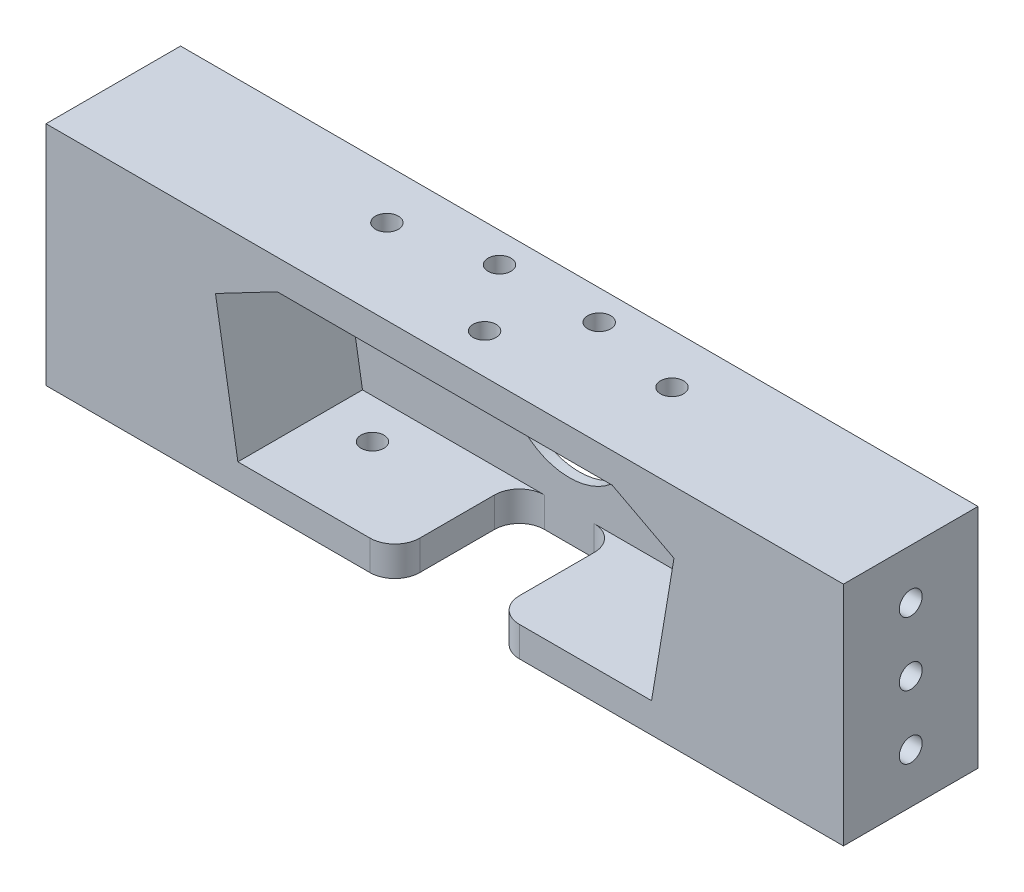
ISO-10303-21;
HEADER;
FILE_DESCRIPTION(('STEP AP214'),'2;1');
FILE_NAME('part.step','',(''),(''),'','','');
FILE_SCHEMA(('AUTOMOTIVE_DESIGN { 1 0 10303 214 1 1 1 1 }'));
ENDSEC;
DATA;
#1=APPLICATION_CONTEXT('core data for automotive mechanical design processes');
#2=APPLICATION_PROTOCOL_DEFINITION('international standard','automotive_design',2000,#1);
#3=PRODUCT_CONTEXT('',#1,'mechanical');
#4=PRODUCT('Part','Part','',(#3));
#5=PRODUCT_RELATED_PRODUCT_CATEGORY('part','',(#4));
#6=PRODUCT_DEFINITION_FORMATION('','',#4);
#7=PRODUCT_DEFINITION_CONTEXT('part definition',#1,'design');
#8=PRODUCT_DEFINITION('design','',#6,#7);
#9=PRODUCT_DEFINITION_SHAPE('','',#8);
#10=(LENGTH_UNIT() NAMED_UNIT(*) SI_UNIT(.MILLI.,.METRE.));
#11=(NAMED_UNIT(*) PLANE_ANGLE_UNIT() SI_UNIT($,.RADIAN.));
#12=(NAMED_UNIT(*) SI_UNIT($,.STERADIAN.) SOLID_ANGLE_UNIT());
#13=UNCERTAINTY_MEASURE_WITH_UNIT(LENGTH_MEASURE(1.E-05),#10,'distance_accuracy_value','');
#14=(GEOMETRIC_REPRESENTATION_CONTEXT(3) GLOBAL_UNCERTAINTY_ASSIGNED_CONTEXT((#13)) GLOBAL_UNIT_ASSIGNED_CONTEXT((#10,
#11,#12)) REPRESENTATION_CONTEXT('',''));
#15=CARTESIAN_POINT('',(0.,0.,0.));
#16=DIRECTION('',(0.,0.,1.));
#17=DIRECTION('',(1.,0.,0.));
#18=AXIS2_PLACEMENT_3D('',#15,#16,#17);
#19=CARTESIAN_POINT('',(41.5,-16.75,25.));
#20=DIRECTION('',(0.,1.,0.));
#21=DIRECTION('',(-1.,0.,0.));
#22=AXIS2_PLACEMENT_3D('',#19,#20,#21);
#23=PLANE('',#22);
#24=CARTESIAN_POINT('',(-31.5,-16.75,8.));
#25=DIRECTION('',(0.,1.,0.));
#26=DIRECTION('',(-1.,0.,0.));
#27=AXIS2_PLACEMENT_3D('',#24,#25,#26);
#28=CIRCLE('',#27,2.3);
#29=CARTESIAN_POINT('',(-33.8,-16.75,8.));
#30=VERTEX_POINT('',#29);
#31=EDGE_CURVE('E392',#30,#30,#28,.T.);
#32=ORIENTED_EDGE('',*,*,#31,.F.);
#33=EDGE_LOOP('',(#32));
#34=FACE_BOUND('',#33,.T.);
#35=DIRECTION('',(1.,0.,0.));
#36=VECTOR('',#35,1.);
#37=CARTESIAN_POINT('',(41.5,-16.75,25.));
#38=LINE('',#37,#36);
#39=CARTESIAN_POINT('',(-41.5,-16.75,25.));
#40=VERTEX_POINT('',#39);
#41=CARTESIAN_POINT('',(-15.,-16.75,25.));
#42=VERTEX_POINT('',#41);
#43=EDGE_CURVE('E205',#40,#42,#38,.T.);
#44=ORIENTED_EDGE('',*,*,#43,.T.);
#45=CARTESIAN_POINT('',(-15.,-16.75,20.));
#46=DIRECTION('',(0.,1.,0.));
#47=DIRECTION('',(-1.,0.,0.));
#48=AXIS2_PLACEMENT_3D('',#45,#46,#47);
#49=CIRCLE('',#48,5.);
#50=CARTESIAN_POINT('',(-9.99999999999999,-16.75,20.));
#51=VERTEX_POINT('',#50);
#52=EDGE_CURVE('E47',#42,#51,#49,.T.);
#53=ORIENTED_EDGE('',*,*,#52,.T.);
#54=DIRECTION('',(0.,0.,1.));
#55=VECTOR('',#54,1.);
#56=CARTESIAN_POINT('',(-10.,-16.75,0.));
#57=LINE('',#56,#55);
#58=CARTESIAN_POINT('',(-10.,-16.75,5.));
#59=VERTEX_POINT('',#58);
#60=EDGE_CURVE('E339',#59,#51,#57,.T.);
#61=ORIENTED_EDGE('',*,*,#60,.F.);
#62=CARTESIAN_POINT('',(-5.,-16.75,5.));
#63=DIRECTION('',(0.,1.,0.));
#64=DIRECTION('',(-1.,0.,0.));
#65=AXIS2_PLACEMENT_3D('',#62,#63,#64);
#66=CIRCLE('',#65,5.);
#67=CARTESIAN_POINT('',(-5.,-16.75,0.));
#68=VERTEX_POINT('',#67);
#69=EDGE_CURVE('E271',#59,#68,#66,.F.);
#70=ORIENTED_EDGE('',*,*,#69,.T.);
#71=DIRECTION('',(1.,0.,0.));
#72=VECTOR('',#71,1.);
#73=CARTESIAN_POINT('',(41.5,-16.75,0.));
#74=LINE('',#73,#72);
#75=CARTESIAN_POINT('',(-41.5,-16.75,0.));
#76=VERTEX_POINT('',#75);
#77=EDGE_CURVE('E221',#76,#68,#74,.T.);
#78=ORIENTED_EDGE('',*,*,#77,.F.);
#79=DIRECTION('',(0.,0.,-1.));
#80=VECTOR('',#79,1.);
#81=CARTESIAN_POINT('',(-41.5,-16.75,25.));
#82=LINE('',#81,#80);
#83=EDGE_CURVE('E239',#40,#76,#82,.T.);
#84=ORIENTED_EDGE('',*,*,#83,.F.);
#85=EDGE_LOOP('',(#44,#53,#61,#70,#78,#84));
#86=FACE_BOUND('',#85,.T.);
#87=ADVANCED_FACE('F39',(#34,#86),#23,.T.);
#88=CARTESIAN_POINT('',(0.,0.,25.));
#89=DIRECTION('',(0.,0.,1.));
#90=DIRECTION('',(1.,0.,0.));
#91=AXIS2_PLACEMENT_3D('',#88,#89,#90);
#92=PLANE('',#91);
#93=CARTESIAN_POINT('',(15.,-16.75,25.));
#94=VERTEX_POINT('',#93);
#95=CARTESIAN_POINT('',(41.5,-16.75,25.));
#96=VERTEX_POINT('',#95);
#97=EDGE_CURVE('E204',#94,#96,#38,.T.);
#98=ORIENTED_EDGE('',*,*,#97,.F.);
#99=DIRECTION('',(0.,1.,0.));
#100=VECTOR('',#99,1.);
#101=CARTESIAN_POINT('',(15.,-22.75,25.));
#102=LINE('',#101,#100);
#103=CARTESIAN_POINT('',(15.,-22.75,25.));
#104=VERTEX_POINT('',#103);
#105=EDGE_CURVE('E285',#94,#104,#102,.F.);
#106=ORIENTED_EDGE('',*,*,#105,.T.);
#107=DIRECTION('',(1.,0.,0.));
#108=VECTOR('',#107,1.);
#109=CARTESIAN_POINT('',(-80.,-22.75,25.));
#110=LINE('',#109,#108);
#111=CARTESIAN_POINT('',(80.,-22.75,25.));
#112=VERTEX_POINT('',#111);
#113=EDGE_CURVE('E249',#104,#112,#110,.T.);
#114=ORIENTED_EDGE('',*,*,#113,.T.);
#115=DIRECTION('',(0.,1.,0.));
#116=VECTOR('',#115,1.);
#117=CARTESIAN_POINT('',(80.,22.75,25.));
#118=LINE('',#117,#116);
#119=CARTESIAN_POINT('',(80.,22.75,25.));
#120=VERTEX_POINT('',#119);
#121=EDGE_CURVE('E244',#112,#120,#118,.T.);
#122=ORIENTED_EDGE('',*,*,#121,.T.);
#123=DIRECTION('',(-1.,0.,0.));
#124=VECTOR('',#123,1.);
#125=CARTESIAN_POINT('',(-80.,22.75,25.));
#126=LINE('',#125,#124);
#127=CARTESIAN_POINT('',(-80.,22.75,25.));
#128=VERTEX_POINT('',#127);
#129=EDGE_CURVE('E168',#120,#128,#126,.T.);
#130=ORIENTED_EDGE('',*,*,#129,.T.);
#131=DIRECTION('',(0.,-1.,0.));
#132=VECTOR('',#131,1.);
#133=CARTESIAN_POINT('',(-80.,22.75,25.));
#134=LINE('',#133,#132);
#135=CARTESIAN_POINT('',(-80.,-22.75,25.));
#136=VERTEX_POINT('',#135);
#137=EDGE_CURVE('E247',#128,#136,#134,.T.);
#138=ORIENTED_EDGE('',*,*,#137,.T.);
#139=CARTESIAN_POINT('',(-15.,-22.75,25.));
#140=VERTEX_POINT('',#139);
#141=EDGE_CURVE('E250',#136,#140,#110,.T.);
#142=ORIENTED_EDGE('',*,*,#141,.T.);
#143=DIRECTION('',(0.,1.,0.));
#144=VECTOR('',#143,1.);
#145=CARTESIAN_POINT('',(-15.,-16.75,25.));
#146=LINE('',#145,#144);
#147=EDGE_CURVE('E282',#140,#42,#146,.T.);
#148=ORIENTED_EDGE('',*,*,#147,.T.);
#149=ORIENTED_EDGE('',*,*,#43,.F.);
#150=DIRECTION('',(0.164398987305357,-0.986393923832144,0.));
#151=VECTOR('',#150,1.);
#152=CARTESIAN_POINT('',(-41.5,-16.75,25.));
#153=LINE('',#152,#151);
#154=CARTESIAN_POINT('',(-46.,10.25,25.));
#155=VERTEX_POINT('',#154);
#156=EDGE_CURVE('E201',#155,#40,#153,.T.);
#157=ORIENTED_EDGE('',*,*,#156,.F.);
#158=DIRECTION('',(-0.88568548340266,-0.464285714285714,0.));
#159=VECTOR('',#158,1.);
#160=CARTESIAN_POINT('',(-46.,10.25,25.));
#161=LINE('',#160,#159);
#162=CARTESIAN_POINT('',(-33.6004032323628,16.75,25.));
#163=VERTEX_POINT('',#162);
#164=EDGE_CURVE('E199',#163,#155,#161,.T.);
#165=ORIENTED_EDGE('',*,*,#164,.F.);
#166=DIRECTION('',(-1.,0.,0.));
#167=VECTOR('',#166,1.);
#168=CARTESIAN_POINT('',(-33.6004032323628,16.75,25.));
#169=LINE('',#168,#167);
#170=CARTESIAN_POINT('',(33.6004032323628,16.75,25.));
#171=VERTEX_POINT('',#170);
#172=EDGE_CURVE('E212',#171,#163,#169,.T.);
#173=ORIENTED_EDGE('',*,*,#172,.F.);
#174=DIRECTION('',(-0.88568548340266,0.464285714285714,0.));
#175=VECTOR('',#174,1.);
#176=CARTESIAN_POINT('',(33.6004032323628,16.75,25.));
#177=LINE('',#176,#175);
#178=CARTESIAN_POINT('',(46.,10.25,25.));
#179=VERTEX_POINT('',#178);
#180=EDGE_CURVE('E209',#179,#171,#177,.T.);
#181=ORIENTED_EDGE('',*,*,#180,.F.);
#182=DIRECTION('',(0.164398987305357,0.986393923832144,0.));
#183=VECTOR('',#182,1.);
#184=CARTESIAN_POINT('',(46.,10.25,25.));
#185=LINE('',#184,#183);
#186=EDGE_CURVE('E207',#96,#179,#185,.T.);
#187=ORIENTED_EDGE('',*,*,#186,.F.);
#188=EDGE_LOOP('',(#98,#106,#114,#122,#130,#138,#142,#148,#149,#157,#165,#173,#181,#187));
#189=FACE_BOUND('',#188,.T.);
#190=ADVANCED_FACE('F316',(#189),#92,.T.);
#191=CARTESIAN_POINT('',(80.,22.75,25.));
#192=DIRECTION('',(-1.,0.,0.));
#193=DIRECTION('',(0.,-1.,0.));
#194=AXIS2_PLACEMENT_3D('',#191,#192,#193);
#195=PLANE('',#194);
#196=CARTESIAN_POINT('',(80.,12.75,11.5));
#197=DIRECTION('',(1.,0.,0.));
#198=DIRECTION('',(0.,1.,0.));
#199=AXIS2_PLACEMENT_3D('',#196,#197,#198);
#200=CIRCLE('',#199,2.3);
#201=CARTESIAN_POINT('',(80.,15.05,11.5));
#202=VERTEX_POINT('',#201);
#203=EDGE_CURVE('E458',#202,#202,#200,.T.);
#204=ORIENTED_EDGE('',*,*,#203,.F.);
#205=EDGE_LOOP('',(#204));
#206=FACE_BOUND('',#205,.T.);
#207=CARTESIAN_POINT('',(80.,0.,11.5));
#208=DIRECTION('',(1.,0.,0.));
#209=DIRECTION('',(0.,1.,0.));
#210=AXIS2_PLACEMENT_3D('',#207,#208,#209);
#211=CIRCLE('',#210,2.3);
#212=CARTESIAN_POINT('',(80.,2.3,11.5));
#213=VERTEX_POINT('',#212);
#214=EDGE_CURVE('E452',#213,#213,#211,.T.);
#215=ORIENTED_EDGE('',*,*,#214,.F.);
#216=EDGE_LOOP('',(#215));
#217=FACE_BOUND('',#216,.T.);
#218=CARTESIAN_POINT('',(80.,-12.75,11.5));
#219=DIRECTION('',(1.,0.,0.));
#220=DIRECTION('',(0.,1.,0.));
#221=AXIS2_PLACEMENT_3D('',#218,#219,#220);
#222=CIRCLE('',#221,2.3);
#223=CARTESIAN_POINT('',(80.,-10.45,11.5));
#224=VERTEX_POINT('',#223);
#225=EDGE_CURVE('E446',#224,#224,#222,.T.);
#226=ORIENTED_EDGE('',*,*,#225,.F.);
#227=EDGE_LOOP('',(#226));
#228=FACE_BOUND('',#227,.T.);
#229=DIRECTION('',(0.,0.,-1.));
#230=VECTOR('',#229,1.);
#231=CARTESIAN_POINT('',(80.,-22.75,25.));
#232=LINE('',#231,#230);
#233=CARTESIAN_POINT('',(80.,-22.75,-2.));
#234=VERTEX_POINT('',#233);
#235=EDGE_CURVE('E179',#112,#234,#232,.T.);
#236=ORIENTED_EDGE('',*,*,#235,.T.);
#237=DIRECTION('',(0.,-1.,0.));
#238=VECTOR('',#237,1.);
#239=CARTESIAN_POINT('',(80.,22.75,-2.));
#240=LINE('',#239,#238);
#241=CARTESIAN_POINT('',(80.,22.75,-2.));
#242=VERTEX_POINT('',#241);
#243=EDGE_CURVE('E176',#242,#234,#240,.T.);
#244=ORIENTED_EDGE('',*,*,#243,.F.);
#245=DIRECTION('',(0.,0.,-1.));
#246=VECTOR('',#245,1.);
#247=CARTESIAN_POINT('',(80.,22.75,25.));
#248=LINE('',#247,#246);
#249=EDGE_CURVE('E162',#120,#242,#248,.T.);
#250=ORIENTED_EDGE('',*,*,#249,.F.);
#251=ORIENTED_EDGE('',*,*,#121,.F.);
#252=EDGE_LOOP('',(#236,#244,#250,#251));
#253=FACE_BOUND('',#252,.T.);
#254=ADVANCED_FACE('F177',(#206,#217,#228,#253),#195,.F.);
#255=CARTESIAN_POINT('',(-80.,22.75,25.));
#256=DIRECTION('',(0.,-1.,0.));
#257=DIRECTION('',(0.,0.,-1.));
#258=AXIS2_PLACEMENT_3D('',#255,#256,#257);
#259=PLANE('',#258);
#260=CARTESIAN_POINT('',(-9.99999999999998,22.75,3.99999999999999));
#261=DIRECTION('',(0.,1.,0.));
#262=DIRECTION('',(0.,0.,1.));
#263=AXIS2_PLACEMENT_3D('',#260,#261,#262);
#264=CIRCLE('',#263,2.3);
#265=CARTESIAN_POINT('',(-9.99999999999998,22.75,6.29999999999999));
#266=VERTEX_POINT('',#265);
#267=EDGE_CURVE('E406',#266,#266,#264,.T.);
#268=ORIENTED_EDGE('',*,*,#267,.F.);
#269=EDGE_LOOP('',(#268));
#270=FACE_BOUND('',#269,.T.);
#271=CARTESIAN_POINT('',(10.,22.75,3.99999999999999));
#272=DIRECTION('',(0.,1.,0.));
#273=DIRECTION('',(0.,0.,1.));
#274=AXIS2_PLACEMENT_3D('',#271,#272,#273);
#275=CIRCLE('',#274,2.3);
#276=CARTESIAN_POINT('',(10.,22.75,6.29999999999999));
#277=VERTEX_POINT('',#276);
#278=EDGE_CURVE('E418',#277,#277,#275,.T.);
#279=ORIENTED_EDGE('',*,*,#278,.F.);
#280=EDGE_LOOP('',(#279));
#281=FACE_BOUND('',#280,.T.);
#282=CARTESIAN_POINT('',(0.,22.75,17.));
#283=DIRECTION('',(0.,1.,0.));
#284=DIRECTION('',(0.,0.,1.));
#285=AXIS2_PLACEMENT_3D('',#282,#283,#284);
#286=CIRCLE('',#285,2.3);
#287=CARTESIAN_POINT('',(0.,22.75,19.3));
#288=VERTEX_POINT('',#287);
#289=EDGE_CURVE('E413',#288,#288,#286,.T.);
#290=ORIENTED_EDGE('',*,*,#289,.F.);
#291=EDGE_LOOP('',(#290));
#292=FACE_BOUND('',#291,.T.);
#293=CARTESIAN_POINT('',(-28.6004032323627,22.75,8.));
#294=DIRECTION('',(0.,-1.,0.));
#295=DIRECTION('',(0.,0.,-1.));
#296=AXIS2_PLACEMENT_3D('',#293,#294,#295);
#297=CIRCLE('',#296,2.3);
#298=CARTESIAN_POINT('',(-28.6004032323627,22.75,5.7));
#299=VERTEX_POINT('',#298);
#300=EDGE_CURVE('E389',#299,#299,#297,.F.);
#301=ORIENTED_EDGE('',*,*,#300,.F.);
#302=EDGE_LOOP('',(#301));
#303=FACE_BOUND('',#302,.T.);
#304=CARTESIAN_POINT('',(28.6004032323628,22.75,8.));
#305=DIRECTION('',(0.,-1.,0.));
#306=DIRECTION('',(0.,0.,-1.));
#307=AXIS2_PLACEMENT_3D('',#304,#305,#306);
#308=CIRCLE('',#307,2.3);
#309=CARTESIAN_POINT('',(28.6004032323628,22.75,5.7));
#310=VERTEX_POINT('',#309);
#311=EDGE_CURVE('E401',#310,#310,#308,.F.);
#312=ORIENTED_EDGE('',*,*,#311,.F.);
#313=EDGE_LOOP('',(#312));
#314=FACE_BOUND('',#313,.T.);
#315=ORIENTED_EDGE('',*,*,#249,.T.);
#316=DIRECTION('',(1.,0.,0.));
#317=VECTOR('',#316,1.);
#318=CARTESIAN_POINT('',(-80.,22.75,-2.));
#319=LINE('',#318,#317);
#320=CARTESIAN_POINT('',(-80.,22.75,-2.));
#321=VERTEX_POINT('',#320);
#322=EDGE_CURVE('E167',#321,#242,#319,.T.);
#323=ORIENTED_EDGE('',*,*,#322,.F.);
#324=DIRECTION('',(0.,0.,-1.));
#325=VECTOR('',#324,1.);
#326=CARTESIAN_POINT('',(-80.,22.75,25.));
#327=LINE('',#326,#325);
#328=EDGE_CURVE('E173',#128,#321,#327,.T.);
#329=ORIENTED_EDGE('',*,*,#328,.F.);
#330=ORIENTED_EDGE('',*,*,#129,.F.);
#331=EDGE_LOOP('',(#315,#323,#329,#330));
#332=FACE_BOUND('',#331,.T.);
#333=ADVANCED_FACE('F164',(#270,#281,#292,#303,#314,#332),#259,.F.);
#334=CARTESIAN_POINT('',(-80.,22.75,25.));
#335=DIRECTION('',(1.,0.,0.));
#336=DIRECTION('',(0.,0.,-1.));
#337=AXIS2_PLACEMENT_3D('',#334,#335,#336);
#338=PLANE('',#337);
#339=CARTESIAN_POINT('',(-80.,12.75,11.5));
#340=DIRECTION('',(-1.,0.,0.));
#341=DIRECTION('',(0.,0.,1.));
#342=AXIS2_PLACEMENT_3D('',#339,#340,#341);
#343=CIRCLE('',#342,2.3);
#344=CARTESIAN_POINT('',(-80.,12.75,13.8));
#345=VERTEX_POINT('',#344);
#346=EDGE_CURVE('E434',#345,#345,#343,.T.);
#347=ORIENTED_EDGE('',*,*,#346,.F.);
#348=EDGE_LOOP('',(#347));
#349=FACE_BOUND('',#348,.T.);
#350=CARTESIAN_POINT('',(-80.,-12.75,11.5));
#351=DIRECTION('',(-1.,0.,0.));
#352=DIRECTION('',(0.,0.,1.));
#353=AXIS2_PLACEMENT_3D('',#350,#351,#352);
#354=CIRCLE('',#353,2.3);
#355=CARTESIAN_POINT('',(-80.,-12.75,13.8));
#356=VERTEX_POINT('',#355);
#357=EDGE_CURVE('E441',#356,#356,#354,.T.);
#358=ORIENTED_EDGE('',*,*,#357,.F.);
#359=EDGE_LOOP('',(#358));
#360=FACE_BOUND('',#359,.T.);
#361=CARTESIAN_POINT('',(-80.,0.,11.5));
#362=DIRECTION('',(-1.,0.,0.));
#363=DIRECTION('',(0.,0.,1.));
#364=AXIS2_PLACEMENT_3D('',#361,#362,#363);
#365=CIRCLE('',#364,2.3);
#366=CARTESIAN_POINT('',(-80.,0.,13.8));
#367=VERTEX_POINT('',#366);
#368=EDGE_CURVE('E428',#367,#367,#365,.T.);
#369=ORIENTED_EDGE('',*,*,#368,.F.);
#370=EDGE_LOOP('',(#369));
#371=FACE_BOUND('',#370,.T.);
#372=ORIENTED_EDGE('',*,*,#328,.T.);
#373=DIRECTION('',(0.,1.,0.));
#374=VECTOR('',#373,1.);
#375=CARTESIAN_POINT('',(-80.,-22.75,-2.));
#376=LINE('',#375,#374);
#377=CARTESIAN_POINT('',(-80.,-22.75,-2.));
#378=VERTEX_POINT('',#377);
#379=EDGE_CURVE('E188',#378,#321,#376,.T.);
#380=ORIENTED_EDGE('',*,*,#379,.F.);
#381=DIRECTION('',(0.,0.,-1.));
#382=VECTOR('',#381,1.);
#383=CARTESIAN_POINT('',(-80.,-22.75,25.));
#384=LINE('',#383,#382);
#385=EDGE_CURVE('E254',#136,#378,#384,.T.);
#386=ORIENTED_EDGE('',*,*,#385,.F.);
#387=ORIENTED_EDGE('',*,*,#137,.F.);
#388=EDGE_LOOP('',(#372,#380,#386,#387));
#389=FACE_BOUND('',#388,.T.);
#390=ADVANCED_FACE('F587',(#349,#360,#371,#389),#338,.F.);
#391=CARTESIAN_POINT('',(-80.,-22.75,25.));
#392=DIRECTION('',(0.,1.,0.));
#393=DIRECTION('',(0.,0.,1.));
#394=AXIS2_PLACEMENT_3D('',#391,#392,#393);
#395=PLANE('',#394);
#396=CARTESIAN_POINT('',(-31.5,-22.75,8.));
#397=DIRECTION('',(0.,1.,0.));
#398=DIRECTION('',(0.,0.,1.));
#399=AXIS2_PLACEMENT_3D('',#396,#397,#398);
#400=CIRCLE('',#399,2.3);
#401=CARTESIAN_POINT('',(-31.5,-22.75,10.3));
#402=VERTEX_POINT('',#401);
#403=EDGE_CURVE('E306',#402,#402,#400,.F.);
#404=ORIENTED_EDGE('',*,*,#403,.F.);
#405=EDGE_LOOP('',(#404));
#406=FACE_BOUND('',#405,.T.);
#407=CARTESIAN_POINT('',(31.5,-22.75,8.));
#408=DIRECTION('',(0.,1.,0.));
#409=DIRECTION('',(0.,0.,1.));
#410=AXIS2_PLACEMENT_3D('',#407,#408,#409);
#411=CIRCLE('',#410,2.3);
#412=CARTESIAN_POINT('',(31.5,-22.75,10.3));
#413=VERTEX_POINT('',#412);
#414=EDGE_CURVE('E388',#413,#413,#411,.F.);
#415=ORIENTED_EDGE('',*,*,#414,.F.);
#416=EDGE_LOOP('',(#415));
#417=FACE_BOUND('',#416,.T.);
#418=ORIENTED_EDGE('',*,*,#113,.F.);
#419=CARTESIAN_POINT('',(15.,-22.75,20.));
#420=DIRECTION('',(0.,1.,0.));
#421=DIRECTION('',(0.,0.,1.));
#422=AXIS2_PLACEMENT_3D('',#419,#420,#421);
#423=CIRCLE('',#422,5.);
#424=CARTESIAN_POINT('',(10.,-22.75,20.));
#425=VERTEX_POINT('',#424);
#426=EDGE_CURVE('E289',#104,#425,#423,.F.);
#427=ORIENTED_EDGE('',*,*,#426,.T.);
#428=DIRECTION('',(0.,0.,1.));
#429=VECTOR('',#428,1.);
#430=CARTESIAN_POINT('',(10.,-22.75,0.));
#431=LINE('',#430,#429);
#432=CARTESIAN_POINT('',(10.,-22.75,5.));
#433=VERTEX_POINT('',#432);
#434=EDGE_CURVE('E296',#433,#425,#431,.T.);
#435=ORIENTED_EDGE('',*,*,#434,.F.);
#436=CARTESIAN_POINT('',(5.,-22.75,5.));
#437=DIRECTION('',(0.,1.,0.));
#438=DIRECTION('',(0.,0.,1.));
#439=AXIS2_PLACEMENT_3D('',#436,#437,#438);
#440=CIRCLE('',#439,5.);
#441=CARTESIAN_POINT('',(5.,-22.75,0.));
#442=VERTEX_POINT('',#441);
#443=EDGE_CURVE('E269',#433,#442,#440,.T.);
#444=ORIENTED_EDGE('',*,*,#443,.T.);
#445=DIRECTION('',(1.,0.,0.));
#446=VECTOR('',#445,1.);
#447=CARTESIAN_POINT('',(-10.,-22.75,0.));
#448=LINE('',#447,#446);
#449=CARTESIAN_POINT('',(-5.,-22.75,0.));
#450=VERTEX_POINT('',#449);
#451=EDGE_CURVE('E305',#450,#442,#448,.T.);
#452=ORIENTED_EDGE('',*,*,#451,.F.);
#453=CARTESIAN_POINT('',(-5.,-22.75,5.));
#454=DIRECTION('',(0.,1.,0.));
#455=DIRECTION('',(0.,0.,1.));
#456=AXIS2_PLACEMENT_3D('',#453,#454,#455);
#457=CIRCLE('',#456,5.);
#458=CARTESIAN_POINT('',(-10.,-22.75,5.));
#459=VERTEX_POINT('',#458);
#460=EDGE_CURVE('E274',#450,#459,#457,.T.);
#461=ORIENTED_EDGE('',*,*,#460,.T.);
#462=DIRECTION('',(0.,0.,-1.));
#463=VECTOR('',#462,1.);
#464=CARTESIAN_POINT('',(-10.,-22.75,0.));
#465=LINE('',#464,#463);
#466=CARTESIAN_POINT('',(-9.99999999999999,-22.75,20.));
#467=VERTEX_POINT('',#466);
#468=EDGE_CURVE('E337',#467,#459,#465,.T.);
#469=ORIENTED_EDGE('',*,*,#468,.F.);
#470=CARTESIAN_POINT('',(-15.,-22.75,20.));
#471=DIRECTION('',(0.,1.,0.));
#472=DIRECTION('',(0.,0.,1.));
#473=AXIS2_PLACEMENT_3D('',#470,#471,#472);
#474=CIRCLE('',#473,5.);
#475=EDGE_CURVE('E287',#467,#140,#474,.F.);
#476=ORIENTED_EDGE('',*,*,#475,.T.);
#477=ORIENTED_EDGE('',*,*,#141,.F.);
#478=ORIENTED_EDGE('',*,*,#385,.T.);
#479=DIRECTION('',(-1.,0.,0.));
#480=VECTOR('',#479,1.);
#481=CARTESIAN_POINT('',(80.,-22.75,-2.));
#482=LINE('',#481,#480);
#483=EDGE_CURVE('E183',#234,#378,#482,.T.);
#484=ORIENTED_EDGE('',*,*,#483,.F.);
#485=ORIENTED_EDGE('',*,*,#235,.F.);
#486=EDGE_LOOP('',(#418,#427,#435,#444,#452,#461,#469,#476,#477,#478,#484,#485));
#487=FACE_BOUND('',#486,.T.);
#488=ADVANCED_FACE('F295',(#406,#417,#487),#395,.F.);
#489=CARTESIAN_POINT('',(-46.,10.25,25.));
#490=DIRECTION('',(0.464285714285714,-0.88568548340266,0.));
#491=DIRECTION('',(0.88568548340266,0.464285714285714,0.));
#492=AXIS2_PLACEMENT_3D('',#489,#490,#491);
#493=PLANE('',#492);
#494=DIRECTION('',(-0.88568548340266,-0.464285714285714,0.));
#495=VECTOR('',#494,1.);
#496=CARTESIAN_POINT('',(-46.,10.25,0.));
#497=LINE('',#496,#495);
#498=CARTESIAN_POINT('',(-33.6004032323628,16.75,0.));
#499=VERTEX_POINT('',#498);
#500=CARTESIAN_POINT('',(-46.,10.25,0.));
#501=VERTEX_POINT('',#500);
#502=EDGE_CURVE('E198',#499,#501,#497,.T.);
#503=ORIENTED_EDGE('',*,*,#502,.F.);
#504=DIRECTION('',(0.,0.,-1.));
#505=VECTOR('',#504,1.);
#506=CARTESIAN_POINT('',(-33.6004032323628,16.75,25.));
#507=LINE('',#506,#505);
#508=EDGE_CURVE('E214',#163,#499,#507,.T.);
#509=ORIENTED_EDGE('',*,*,#508,.F.);
#510=ORIENTED_EDGE('',*,*,#164,.T.);
#511=DIRECTION('',(0.,0.,-1.));
#512=VECTOR('',#511,1.);
#513=CARTESIAN_POINT('',(-46.,10.25,25.));
#514=LINE('',#513,#512);
#515=EDGE_CURVE('E241',#155,#501,#514,.T.);
#516=ORIENTED_EDGE('',*,*,#515,.T.);
#517=EDGE_LOOP('',(#503,#509,#510,#516));
#518=FACE_BOUND('',#517,.T.);
#519=ADVANCED_FACE('F382',(#518),#493,.T.);
#520=CARTESIAN_POINT('',(-41.5,-16.75,25.));
#521=DIRECTION('',(0.986393923832144,0.164398987305357,0.));
#522=DIRECTION('',(-0.164398987305357,0.986393923832144,0.));
#523=AXIS2_PLACEMENT_3D('',#520,#521,#522);
#524=PLANE('',#523);
#525=DIRECTION('',(0.164398987305357,-0.986393923832144,0.));
#526=VECTOR('',#525,1.);
#527=CARTESIAN_POINT('',(-41.5,-16.75,0.));
#528=LINE('',#527,#526);
#529=EDGE_CURVE('E217',#501,#76,#528,.T.);
#530=ORIENTED_EDGE('',*,*,#529,.F.);
#531=ORIENTED_EDGE('',*,*,#515,.F.);
#532=ORIENTED_EDGE('',*,*,#156,.T.);
#533=ORIENTED_EDGE('',*,*,#83,.T.);
#534=EDGE_LOOP('',(#530,#531,#532,#533));
#535=FACE_BOUND('',#534,.T.);
#536=ADVANCED_FACE('F375',(#535),#524,.T.);
#537=CARTESIAN_POINT('',(31.5,-16.75,8.));
#538=DIRECTION('',(0.,1.,0.));
#539=DIRECTION('',(-1.,0.,0.));
#540=AXIS2_PLACEMENT_3D('',#537,#538,#539);
#541=CIRCLE('',#540,2.3);
#542=CARTESIAN_POINT('',(29.2,-16.75,8.));
#543=VERTEX_POINT('',#542);
#544=EDGE_CURVE('E386',#543,#543,#541,.T.);
#545=ORIENTED_EDGE('',*,*,#544,.F.);
#546=EDGE_LOOP('',(#545));
#547=FACE_BOUND('',#546,.T.);
#548=DIRECTION('',(0.,0.,-1.));
#549=VECTOR('',#548,1.);
#550=CARTESIAN_POINT('',(10.,-16.75,0.));
#551=LINE('',#550,#549);
#552=CARTESIAN_POINT('',(10.,-16.75,20.));
#553=VERTEX_POINT('',#552);
#554=CARTESIAN_POINT('',(10.,-16.75,5.));
#555=VERTEX_POINT('',#554);
#556=EDGE_CURVE('E313',#553,#555,#551,.T.);
#557=ORIENTED_EDGE('',*,*,#556,.F.);
#558=CARTESIAN_POINT('',(15.,-16.75,20.));
#559=DIRECTION('',(0.,1.,0.));
#560=DIRECTION('',(-1.,0.,0.));
#561=AXIS2_PLACEMENT_3D('',#558,#559,#560);
#562=CIRCLE('',#561,5.);
#563=EDGE_CURVE('E280',#553,#94,#562,.T.);
#564=ORIENTED_EDGE('',*,*,#563,.T.);
#565=ORIENTED_EDGE('',*,*,#97,.T.);
#566=DIRECTION('',(0.,0.,-1.));
#567=VECTOR('',#566,1.);
#568=CARTESIAN_POINT('',(41.5,-16.75,25.));
#569=LINE('',#568,#567);
#570=CARTESIAN_POINT('',(41.5,-16.75,0.));
#571=VERTEX_POINT('',#570);
#572=EDGE_CURVE('E236',#96,#571,#569,.T.);
#573=ORIENTED_EDGE('',*,*,#572,.T.);
#574=CARTESIAN_POINT('',(5.,-16.75,0.));
#575=VERTEX_POINT('',#574);
#576=EDGE_CURVE('E220',#575,#571,#74,.T.);
#577=ORIENTED_EDGE('',*,*,#576,.F.);
#578=CARTESIAN_POINT('',(5.,-16.75,5.));
#579=DIRECTION('',(0.,1.,0.));
#580=DIRECTION('',(-1.,0.,0.));
#581=AXIS2_PLACEMENT_3D('',#578,#579,#580);
#582=CIRCLE('',#581,5.);
#583=EDGE_CURVE('E266',#575,#555,#582,.F.);
#584=ORIENTED_EDGE('',*,*,#583,.T.);
#585=EDGE_LOOP('',(#557,#564,#565,#573,#577,#584));
#586=FACE_BOUND('',#585,.T.);
#587=ADVANCED_FACE('F311',(#547,#586),#23,.T.);
#588=CARTESIAN_POINT('',(46.,10.25,25.));
#589=DIRECTION('',(-0.986393923832144,0.164398987305357,0.));
#590=DIRECTION('',(-0.164398987305357,-0.986393923832144,0.));
#591=AXIS2_PLACEMENT_3D('',#588,#589,#590);
#592=PLANE('',#591);
#593=DIRECTION('',(0.164398987305357,0.986393923832144,0.));
#594=VECTOR('',#593,1.);
#595=CARTESIAN_POINT('',(46.,10.25,0.));
#596=LINE('',#595,#594);
#597=CARTESIAN_POINT('',(46.,10.25,0.));
#598=VERTEX_POINT('',#597);
#599=EDGE_CURVE('E223',#571,#598,#596,.T.);
#600=ORIENTED_EDGE('',*,*,#599,.F.);
#601=ORIENTED_EDGE('',*,*,#572,.F.);
#602=ORIENTED_EDGE('',*,*,#186,.T.);
#603=DIRECTION('',(0.,0.,-1.));
#604=VECTOR('',#603,1.);
#605=CARTESIAN_POINT('',(46.,10.25,25.));
#606=LINE('',#605,#604);
#607=EDGE_CURVE('E234',#179,#598,#606,.T.);
#608=ORIENTED_EDGE('',*,*,#607,.T.);
#609=EDGE_LOOP('',(#600,#601,#602,#608));
#610=FACE_BOUND('',#609,.T.);
#611=ADVANCED_FACE('F322',(#610),#592,.T.);
#612=CARTESIAN_POINT('',(33.6004032323628,16.75,25.));
#613=DIRECTION('',(-0.464285714285715,-0.88568548340266,0.));
#614=DIRECTION('',(0.88568548340266,-0.464285714285714,0.));
#615=AXIS2_PLACEMENT_3D('',#612,#613,#614);
#616=PLANE('',#615);
#617=DIRECTION('',(-0.88568548340266,0.464285714285714,0.));
#618=VECTOR('',#617,1.);
#619=CARTESIAN_POINT('',(33.6004032323628,16.75,0.));
#620=LINE('',#619,#618);
#621=CARTESIAN_POINT('',(33.6004032323628,16.75,0.));
#622=VERTEX_POINT('',#621);
#623=EDGE_CURVE('E226',#598,#622,#620,.T.);
#624=ORIENTED_EDGE('',*,*,#623,.F.);
#625=ORIENTED_EDGE('',*,*,#607,.F.);
#626=ORIENTED_EDGE('',*,*,#180,.T.);
#627=DIRECTION('',(0.,0.,-1.));
#628=VECTOR('',#627,1.);
#629=CARTESIAN_POINT('',(33.6004032323628,16.75,25.));
#630=LINE('',#629,#628);
#631=EDGE_CURVE('E232',#171,#622,#630,.T.);
#632=ORIENTED_EDGE('',*,*,#631,.T.);
#633=EDGE_LOOP('',(#624,#625,#626,#632));
#634=FACE_BOUND('',#633,.T.);
#635=ADVANCED_FACE('F325',(#634),#616,.T.);
#636=CARTESIAN_POINT('',(-33.6004032323628,16.75,25.));
#637=DIRECTION('',(0.,-1.,0.));
#638=DIRECTION('',(1.,0.,0.));
#639=AXIS2_PLACEMENT_3D('',#636,#637,#638);
#640=PLANE('',#639);
#641=CARTESIAN_POINT('',(-9.99999999999998,16.75,3.99999999999999));
#642=DIRECTION('',(0.,-1.,0.));
#643=DIRECTION('',(1.,0.,0.));
#644=AXIS2_PLACEMENT_3D('',#641,#642,#643);
#645=CIRCLE('',#644,2.3);
#646=CARTESIAN_POINT('',(-7.69999999999998,16.75,3.99999999999999));
#647=VERTEX_POINT('',#646);
#648=EDGE_CURVE('E421',#647,#647,#645,.F.);
#649=ORIENTED_EDGE('',*,*,#648,.T.);
#650=EDGE_LOOP('',(#649));
#651=FACE_BOUND('',#650,.T.);
#652=CARTESIAN_POINT('',(10.,16.75,3.99999999999999));
#653=DIRECTION('',(0.,-1.,0.));
#654=DIRECTION('',(1.,0.,0.));
#655=AXIS2_PLACEMENT_3D('',#652,#653,#654);
#656=CIRCLE('',#655,2.3);
#657=CARTESIAN_POINT('',(12.3,16.75,3.99999999999999));
#658=VERTEX_POINT('',#657);
#659=EDGE_CURVE('E417',#658,#658,#656,.F.);
#660=ORIENTED_EDGE('',*,*,#659,.T.);
#661=EDGE_LOOP('',(#660));
#662=FACE_BOUND('',#661,.T.);
#663=CARTESIAN_POINT('',(0.,16.75,17.));
#664=DIRECTION('',(0.,-1.,0.));
#665=DIRECTION('',(1.,0.,0.));
#666=AXIS2_PLACEMENT_3D('',#663,#664,#665);
#667=CIRCLE('',#666,2.3);
#668=CARTESIAN_POINT('',(2.3,16.75,17.));
#669=VERTEX_POINT('',#668);
#670=EDGE_CURVE('E410',#669,#669,#667,.F.);
#671=ORIENTED_EDGE('',*,*,#670,.T.);
#672=EDGE_LOOP('',(#671));
#673=FACE_BOUND('',#672,.T.);
#674=CARTESIAN_POINT('',(-28.6004032323627,16.75,8.));
#675=DIRECTION('',(0.,-1.,0.));
#676=DIRECTION('',(0.,0.,-1.));
#677=AXIS2_PLACEMENT_3D('',#674,#675,#676);
#678=CIRCLE('',#677,2.3);
#679=CARTESIAN_POINT('',(-28.6004032323627,16.75,5.7));
#680=VERTEX_POINT('',#679);
#681=EDGE_CURVE('E394',#680,#680,#678,.T.);
#682=ORIENTED_EDGE('',*,*,#681,.F.);
#683=EDGE_LOOP('',(#682));
#684=FACE_BOUND('',#683,.T.);
#685=CARTESIAN_POINT('',(28.6004032323628,16.75,8.));
#686=DIRECTION('',(0.,-1.,0.));
#687=DIRECTION('',(0.,0.,-1.));
#688=AXIS2_PLACEMENT_3D('',#685,#686,#687);
#689=CIRCLE('',#688,2.3);
#690=CARTESIAN_POINT('',(28.6004032323628,16.75,5.7));
#691=VERTEX_POINT('',#690);
#692=EDGE_CURVE('E404',#691,#691,#689,.T.);
#693=ORIENTED_EDGE('',*,*,#692,.F.);
#694=EDGE_LOOP('',(#693));
#695=FACE_BOUND('',#694,.T.);
#696=DIRECTION('',(-1.,0.,0.));
#697=VECTOR('',#696,1.);
#698=CARTESIAN_POINT('',(-33.6004032323628,16.75,0.));
#699=LINE('',#698,#697);
#700=EDGE_CURVE('E202',#622,#499,#699,.T.);
#701=ORIENTED_EDGE('',*,*,#700,.F.);
#702=ORIENTED_EDGE('',*,*,#631,.F.);
#703=ORIENTED_EDGE('',*,*,#172,.T.);
#704=ORIENTED_EDGE('',*,*,#508,.T.);
#705=EDGE_LOOP('',(#701,#702,#703,#704));
#706=FACE_BOUND('',#705,.T.);
#707=ADVANCED_FACE('F350',(#651,#662,#673,#684,#695,#706),#640,.T.);
#708=CARTESIAN_POINT('',(0.,0.,0.));
#709=DIRECTION('',(0.,0.,-1.));
#710=DIRECTION('',(-1.,0.,0.));
#711=AXIS2_PLACEMENT_3D('',#708,#709,#710);
#712=PLANE('',#711);
#713=CARTESIAN_POINT('',(0.,1.75,0.));
#714=DIRECTION('',(0.,0.,1.));
#715=DIRECTION('',(1.,0.,0.));
#716=AXIS2_PLACEMENT_3D('',#713,#714,#715);
#717=CIRCLE('',#716,13.);
#718=CARTESIAN_POINT('',(13.,1.75,0.));
#719=VERTEX_POINT('',#718);
#720=EDGE_CURVE('E192',#719,#719,#717,.T.);
#721=ORIENTED_EDGE('',*,*,#720,.F.);
#722=EDGE_LOOP('',(#721));
#723=FACE_BOUND('',#722,.T.);
#724=ORIENTED_EDGE('',*,*,#451,.T.);
#725=DIRECTION('',(0.,1.,0.));
#726=VECTOR('',#725,1.);
#727=CARTESIAN_POINT('',(5.,-16.75,0.));
#728=LINE('',#727,#726);
#729=EDGE_CURVE('E258',#442,#575,#728,.T.);
#730=ORIENTED_EDGE('',*,*,#729,.T.);
#731=ORIENTED_EDGE('',*,*,#576,.T.);
#732=ORIENTED_EDGE('',*,*,#599,.T.);
#733=ORIENTED_EDGE('',*,*,#623,.T.);
#734=ORIENTED_EDGE('',*,*,#700,.T.);
#735=ORIENTED_EDGE('',*,*,#502,.T.);
#736=ORIENTED_EDGE('',*,*,#529,.T.);
#737=ORIENTED_EDGE('',*,*,#77,.T.);
#738=DIRECTION('',(0.,1.,0.));
#739=VECTOR('',#738,1.);
#740=CARTESIAN_POINT('',(-5.,-22.75,0.));
#741=LINE('',#740,#739);
#742=EDGE_CURVE('E172',#68,#450,#741,.F.);
#743=ORIENTED_EDGE('',*,*,#742,.T.);
#744=EDGE_LOOP('',(#724,#730,#731,#732,#733,#734,#735,#736,#737,#743));
#745=FACE_BOUND('',#744,.T.);
#746=ADVANCED_FACE('F329',(#723,#745),#712,.F.);
#747=CARTESIAN_POINT('',(0.,0.,-2.));
#748=DIRECTION('',(0.,0.,-1.));
#749=DIRECTION('',(-1.,0.,0.));
#750=AXIS2_PLACEMENT_3D('',#747,#748,#749);
#751=PLANE('',#750);
#752=CARTESIAN_POINT('',(0.,1.75,-2.));
#753=DIRECTION('',(0.,0.,1.));
#754=DIRECTION('',(1.,0.,0.));
#755=AXIS2_PLACEMENT_3D('',#752,#753,#754);
#756=CIRCLE('',#755,13.);
#757=CARTESIAN_POINT('',(13.,1.75,-2.));
#758=VERTEX_POINT('',#757);
#759=EDGE_CURVE('E189',#758,#758,#756,.T.);
#760=ORIENTED_EDGE('',*,*,#759,.T.);
#761=EDGE_LOOP('',(#760));
#762=FACE_BOUND('',#761,.T.);
#763=ORIENTED_EDGE('',*,*,#322,.T.);
#764=ORIENTED_EDGE('',*,*,#243,.T.);
#765=ORIENTED_EDGE('',*,*,#483,.T.);
#766=ORIENTED_EDGE('',*,*,#379,.T.);
#767=EDGE_LOOP('',(#763,#764,#765,#766));
#768=FACE_BOUND('',#767,.T.);
#769=ADVANCED_FACE('F186',(#762,#768),#751,.T.);
#770=CARTESIAN_POINT('',(0.,1.75,-2.));
#771=DIRECTION('',(0.,0.,1.));
#772=DIRECTION('',(1.,0.,0.));
#773=AXIS2_PLACEMENT_3D('',#770,#771,#772);
#774=CYLINDRICAL_SURFACE('',#773,13.);
#775=ORIENTED_EDGE('',*,*,#759,.F.);
#776=EDGE_LOOP('',(#775));
#777=FACE_BOUND('',#776,.T.);
#778=ORIENTED_EDGE('',*,*,#720,.T.);
#779=EDGE_LOOP('',(#778));
#780=FACE_BOUND('',#779,.T.);
#781=ADVANCED_FACE('F347',(#777,#780),#774,.F.);
#782=CARTESIAN_POINT('',(-10.,-22.751,0.));
#783=DIRECTION('',(-1.,0.,0.));
#784=DIRECTION('',(0.,0.,1.));
#785=AXIS2_PLACEMENT_3D('',#782,#783,#784);
#786=PLANE('',#785);
#787=ORIENTED_EDGE('',*,*,#60,.T.);
#788=DIRECTION('',(0.,1.,0.));
#789=VECTOR('',#788,1.);
#790=CARTESIAN_POINT('',(-9.99999999999999,-22.75,20.));
#791=LINE('',#790,#789);
#792=EDGE_CURVE('E11',#51,#467,#791,.F.);
#793=ORIENTED_EDGE('',*,*,#792,.T.);
#794=ORIENTED_EDGE('',*,*,#468,.T.);
#795=DIRECTION('',(0.,1.,0.));
#796=VECTOR('',#795,1.);
#797=CARTESIAN_POINT('',(-10.,-16.75,5.));
#798=LINE('',#797,#796);
#799=EDGE_CURVE('E263',#459,#59,#798,.T.);
#800=ORIENTED_EDGE('',*,*,#799,.T.);
#801=EDGE_LOOP('',(#787,#793,#794,#800));
#802=FACE_BOUND('',#801,.T.);
#803=ADVANCED_FACE('F546',(#802),#786,.F.);
#804=CARTESIAN_POINT('',(10.,-22.751,0.));
#805=DIRECTION('',(1.,0.,0.));
#806=DIRECTION('',(0.,0.,-1.));
#807=AXIS2_PLACEMENT_3D('',#804,#805,#806);
#808=PLANE('',#807);
#809=ORIENTED_EDGE('',*,*,#434,.T.);
#810=DIRECTION('',(0.,1.,0.));
#811=VECTOR('',#810,1.);
#812=CARTESIAN_POINT('',(10.,-16.75,20.));
#813=LINE('',#812,#811);
#814=EDGE_CURVE('E277',#425,#553,#813,.T.);
#815=ORIENTED_EDGE('',*,*,#814,.T.);
#816=ORIENTED_EDGE('',*,*,#556,.T.);
#817=DIRECTION('',(0.,1.,0.));
#818=VECTOR('',#817,1.);
#819=CARTESIAN_POINT('',(10.,-22.75,5.));
#820=LINE('',#819,#818);
#821=EDGE_CURVE('E261',#555,#433,#820,.F.);
#822=ORIENTED_EDGE('',*,*,#821,.T.);
#823=EDGE_LOOP('',(#809,#815,#816,#822));
#824=FACE_BOUND('',#823,.T.);
#825=ADVANCED_FACE('F302',(#824),#808,.F.);
#826=CARTESIAN_POINT('',(5.,0.,5.));
#827=DIRECTION('',(0.,-1.,0.));
#828=DIRECTION('',(1.,0.,0.));
#829=AXIS2_PLACEMENT_3D('',#826,#827,#828);
#830=CYLINDRICAL_SURFACE('',#829,5.);
#831=ORIENTED_EDGE('',*,*,#443,.F.);
#832=ORIENTED_EDGE('',*,*,#821,.F.);
#833=ORIENTED_EDGE('',*,*,#583,.F.);
#834=ORIENTED_EDGE('',*,*,#729,.F.);
#835=EDGE_LOOP('',(#831,#832,#833,#834));
#836=FACE_BOUND('',#835,.T.);
#837=ADVANCED_FACE('F333',(#836),#830,.F.);
#838=CARTESIAN_POINT('',(-5.,-22.751,5.));
#839=DIRECTION('',(0.,-1.,0.));
#840=DIRECTION('',(1.,0.,0.));
#841=AXIS2_PLACEMENT_3D('',#838,#839,#840);
#842=CYLINDRICAL_SURFACE('',#841,5.);
#843=ORIENTED_EDGE('',*,*,#460,.F.);
#844=ORIENTED_EDGE('',*,*,#742,.F.);
#845=ORIENTED_EDGE('',*,*,#69,.F.);
#846=ORIENTED_EDGE('',*,*,#799,.F.);
#847=EDGE_LOOP('',(#843,#844,#845,#846));
#848=FACE_BOUND('',#847,.T.);
#849=ADVANCED_FACE('F620',(#848),#842,.F.);
#850=CARTESIAN_POINT('',(15.,-22.751,20.));
#851=DIRECTION('',(0.,-1.,0.));
#852=DIRECTION('',(1.,0.,0.));
#853=AXIS2_PLACEMENT_3D('',#850,#851,#852);
#854=CYLINDRICAL_SURFACE('',#853,5.);
#855=ORIENTED_EDGE('',*,*,#426,.F.);
#856=ORIENTED_EDGE('',*,*,#105,.F.);
#857=ORIENTED_EDGE('',*,*,#563,.F.);
#858=ORIENTED_EDGE('',*,*,#814,.F.);
#859=EDGE_LOOP('',(#855,#856,#857,#858));
#860=FACE_BOUND('',#859,.T.);
#861=ADVANCED_FACE('F308',(#860),#854,.T.);
#862=CARTESIAN_POINT('',(-15.,0.,20.));
#863=DIRECTION('',(0.,-1.,0.));
#864=DIRECTION('',(1.,0.,0.));
#865=AXIS2_PLACEMENT_3D('',#862,#863,#864);
#866=CYLINDRICAL_SURFACE('',#865,5.);
#867=ORIENTED_EDGE('',*,*,#475,.F.);
#868=ORIENTED_EDGE('',*,*,#792,.F.);
#869=ORIENTED_EDGE('',*,*,#52,.F.);
#870=ORIENTED_EDGE('',*,*,#147,.F.);
#871=EDGE_LOOP('',(#867,#868,#869,#870));
#872=FACE_BOUND('',#871,.T.);
#873=ADVANCED_FACE('F41',(#872),#866,.T.);
#874=CARTESIAN_POINT('',(31.5,-22.751,8.));
#875=DIRECTION('',(0.,1.,0.));
#876=DIRECTION('',(-1.,0.,0.));
#877=AXIS2_PLACEMENT_3D('',#874,#875,#876);
#878=CYLINDRICAL_SURFACE('',#877,2.3);
#879=ORIENTED_EDGE('',*,*,#544,.T.);
#880=EDGE_LOOP('',(#879));
#881=FACE_BOUND('',#880,.T.);
#882=ORIENTED_EDGE('',*,*,#414,.T.);
#883=EDGE_LOOP('',(#882));
#884=FACE_BOUND('',#883,.T.);
#885=ADVANCED_FACE('F541',(#881,#884),#878,.F.);
#886=CARTESIAN_POINT('',(-31.5,-22.751,8.));
#887=DIRECTION('',(0.,1.,0.));
#888=DIRECTION('',(-1.,0.,0.));
#889=AXIS2_PLACEMENT_3D('',#886,#887,#888);
#890=CYLINDRICAL_SURFACE('',#889,2.3);
#891=ORIENTED_EDGE('',*,*,#31,.T.);
#892=EDGE_LOOP('',(#891));
#893=FACE_BOUND('',#892,.T.);
#894=ORIENTED_EDGE('',*,*,#403,.T.);
#895=EDGE_LOOP('',(#894));
#896=FACE_BOUND('',#895,.T.);
#897=ADVANCED_FACE('F537',(#893,#896),#890,.F.);
#898=CARTESIAN_POINT('',(28.6004032323628,22.751,8.));
#899=DIRECTION('',(0.,-1.,0.));
#900=DIRECTION('',(0.,0.,-1.));
#901=AXIS2_PLACEMENT_3D('',#898,#899,#900);
#902=CYLINDRICAL_SURFACE('',#901,2.3);
#903=ORIENTED_EDGE('',*,*,#692,.T.);
#904=EDGE_LOOP('',(#903));
#905=FACE_BOUND('',#904,.T.);
#906=ORIENTED_EDGE('',*,*,#311,.T.);
#907=EDGE_LOOP('',(#906));
#908=FACE_BOUND('',#907,.T.);
#909=ADVANCED_FACE('F533',(#905,#908),#902,.F.);
#910=CARTESIAN_POINT('',(-28.6004032323627,22.751,8.));
#911=DIRECTION('',(0.,-1.,0.));
#912=DIRECTION('',(0.,0.,-1.));
#913=AXIS2_PLACEMENT_3D('',#910,#911,#912);
#914=CYLINDRICAL_SURFACE('',#913,2.3);
#915=ORIENTED_EDGE('',*,*,#681,.T.);
#916=EDGE_LOOP('',(#915));
#917=FACE_BOUND('',#916,.T.);
#918=ORIENTED_EDGE('',*,*,#300,.T.);
#919=EDGE_LOOP('',(#918));
#920=FACE_BOUND('',#919,.T.);
#921=ADVANCED_FACE('F529',(#917,#920),#914,.F.);
#922=CARTESIAN_POINT('',(0.,-22.751,17.));
#923=DIRECTION('',(0.,1.,0.));
#924=DIRECTION('',(0.,0.,1.));
#925=AXIS2_PLACEMENT_3D('',#922,#923,#924);
#926=CYLINDRICAL_SURFACE('',#925,2.3);
#927=ORIENTED_EDGE('',*,*,#670,.F.);
#928=EDGE_LOOP('',(#927));
#929=FACE_BOUND('',#928,.T.);
#930=ORIENTED_EDGE('',*,*,#289,.T.);
#931=EDGE_LOOP('',(#930));
#932=FACE_BOUND('',#931,.T.);
#933=ADVANCED_FACE('F525',(#929,#932),#926,.F.);
#934=CARTESIAN_POINT('',(10.,-22.751,3.99999999999999));
#935=DIRECTION('',(0.,1.,0.));
#936=DIRECTION('',(0.,0.,1.));
#937=AXIS2_PLACEMENT_3D('',#934,#935,#936);
#938=CYLINDRICAL_SURFACE('',#937,2.3);
#939=ORIENTED_EDGE('',*,*,#659,.F.);
#940=EDGE_LOOP('',(#939));
#941=FACE_BOUND('',#940,.T.);
#942=ORIENTED_EDGE('',*,*,#278,.T.);
#943=EDGE_LOOP('',(#942));
#944=FACE_BOUND('',#943,.T.);
#945=ADVANCED_FACE('F521',(#941,#944),#938,.F.);
#946=CARTESIAN_POINT('',(-9.99999999999998,-22.751,3.99999999999999));
#947=DIRECTION('',(0.,1.,0.));
#948=DIRECTION('',(0.,0.,1.));
#949=AXIS2_PLACEMENT_3D('',#946,#947,#948);
#950=CYLINDRICAL_SURFACE('',#949,2.3);
#951=ORIENTED_EDGE('',*,*,#648,.F.);
#952=EDGE_LOOP('',(#951));
#953=FACE_BOUND('',#952,.T.);
#954=ORIENTED_EDGE('',*,*,#267,.T.);
#955=EDGE_LOOP('',(#954));
#956=FACE_BOUND('',#955,.T.);
#957=ADVANCED_FACE('F517',(#953,#956),#950,.F.);
#958=CARTESIAN_POINT('',(-60.,0.,11.5));
#959=DIRECTION('',(-1.,0.,0.));
#960=DIRECTION('',(0.,0.,1.));
#961=AXIS2_PLACEMENT_3D('',#958,#959,#960);
#962=CYLINDRICAL_SURFACE('',#961,2.3);
#963=CARTESIAN_POINT('',(-60.,0.,11.5));
#964=DIRECTION('',(-1.,0.,0.));
#965=DIRECTION('',(0.,0.,1.));
#966=AXIS2_PLACEMENT_3D('',#963,#964,#965);
#967=CIRCLE('',#966,2.3);
#968=CARTESIAN_POINT('',(-60.,0.,13.8));
#969=VERTEX_POINT('',#968);
#970=EDGE_CURVE('E414',#969,#969,#967,.T.);
#971=ORIENTED_EDGE('',*,*,#970,.F.);
#972=EDGE_LOOP('',(#971));
#973=FACE_BOUND('',#972,.T.);
#974=ORIENTED_EDGE('',*,*,#368,.T.);
#975=EDGE_LOOP('',(#974));
#976=FACE_BOUND('',#975,.T.);
#977=ADVANCED_FACE('F513',(#973,#976),#962,.F.);
#978=CARTESIAN_POINT('',(-60.,0.,11.5));
#979=DIRECTION('',(-1.,0.,0.));
#980=DIRECTION('',(0.,0.,1.));
#981=AXIS2_PLACEMENT_3D('',#978,#979,#980);
#982=PLANE('',#981);
#983=ORIENTED_EDGE('',*,*,#970,.T.);
#984=EDGE_LOOP('',(#983));
#985=FACE_BOUND('',#984,.T.);
#986=ADVANCED_FACE('F505',(#985),#982,.T.);
#987=CARTESIAN_POINT('',(-60.,-12.75,11.5));
#988=DIRECTION('',(-1.,0.,0.));
#989=DIRECTION('',(0.,0.,1.));
#990=AXIS2_PLACEMENT_3D('',#987,#988,#989);
#991=CYLINDRICAL_SURFACE('',#990,2.3);
#992=CARTESIAN_POINT('',(-60.,-12.75,11.5));
#993=DIRECTION('',(-1.,0.,0.));
#994=DIRECTION('',(0.,0.,1.));
#995=AXIS2_PLACEMENT_3D('',#992,#993,#994);
#996=CIRCLE('',#995,2.3);
#997=CARTESIAN_POINT('',(-60.,-12.75,13.8));
#998=VERTEX_POINT('',#997);
#999=EDGE_CURVE('E431',#998,#998,#996,.T.);
#1000=ORIENTED_EDGE('',*,*,#999,.F.);
#1001=EDGE_LOOP('',(#1000));
#1002=FACE_BOUND('',#1001,.T.);
#1003=ORIENTED_EDGE('',*,*,#357,.T.);
#1004=EDGE_LOOP('',(#1003));
#1005=FACE_BOUND('',#1004,.T.);
#1006=ADVANCED_FACE('F502',(#1002,#1005),#991,.F.);
#1007=CARTESIAN_POINT('',(-60.,-12.75,11.5));
#1008=DIRECTION('',(-1.,0.,0.));
#1009=DIRECTION('',(0.,0.,1.));
#1010=AXIS2_PLACEMENT_3D('',#1007,#1008,#1009);
#1011=PLANE('',#1010);
#1012=ORIENTED_EDGE('',*,*,#999,.T.);
#1013=EDGE_LOOP('',(#1012));
#1014=FACE_BOUND('',#1013,.T.);
#1015=ADVANCED_FACE('F499',(#1014),#1011,.T.);
#1016=CARTESIAN_POINT('',(-60.,12.75,11.5));
#1017=DIRECTION('',(-1.,0.,0.));
#1018=DIRECTION('',(0.,0.,1.));
#1019=AXIS2_PLACEMENT_3D('',#1016,#1017,#1018);
#1020=CYLINDRICAL_SURFACE('',#1019,2.3);
#1021=CARTESIAN_POINT('',(-60.,12.75,11.5));
#1022=DIRECTION('',(-1.,0.,0.));
#1023=DIRECTION('',(0.,0.,1.));
#1024=AXIS2_PLACEMENT_3D('',#1021,#1022,#1023);
#1025=CIRCLE('',#1024,2.3);
#1026=CARTESIAN_POINT('',(-60.,12.75,13.8));
#1027=VERTEX_POINT('',#1026);
#1028=EDGE_CURVE('E437',#1027,#1027,#1025,.T.);
#1029=ORIENTED_EDGE('',*,*,#1028,.F.);
#1030=EDGE_LOOP('',(#1029));
#1031=FACE_BOUND('',#1030,.T.);
#1032=ORIENTED_EDGE('',*,*,#346,.T.);
#1033=EDGE_LOOP('',(#1032));
#1034=FACE_BOUND('',#1033,.T.);
#1035=ADVANCED_FACE('F493',(#1031,#1034),#1020,.F.);
#1036=CARTESIAN_POINT('',(-60.,12.75,11.5));
#1037=DIRECTION('',(-1.,0.,0.));
#1038=DIRECTION('',(0.,0.,1.));
#1039=AXIS2_PLACEMENT_3D('',#1036,#1037,#1038);
#1040=PLANE('',#1039);
#1041=ORIENTED_EDGE('',*,*,#1028,.T.);
#1042=EDGE_LOOP('',(#1041));
#1043=FACE_BOUND('',#1042,.T.);
#1044=ADVANCED_FACE('F483',(#1043),#1040,.T.);
#1045=CARTESIAN_POINT('',(60.,-12.75,11.5));
#1046=DIRECTION('',(1.,0.,0.));
#1047=DIRECTION('',(0.,1.,0.));
#1048=AXIS2_PLACEMENT_3D('',#1045,#1046,#1047);
#1049=CYLINDRICAL_SURFACE('',#1048,2.3);
#1050=CARTESIAN_POINT('',(60.,-12.75,11.5));
#1051=DIRECTION('',(1.,0.,0.));
#1052=DIRECTION('',(0.,1.,0.));
#1053=AXIS2_PLACEMENT_3D('',#1050,#1051,#1052);
#1054=CIRCLE('',#1053,2.3);
#1055=CARTESIAN_POINT('',(60.,-10.45,11.5));
#1056=VERTEX_POINT('',#1055);
#1057=EDGE_CURVE('E449',#1056,#1056,#1054,.T.);
#1058=ORIENTED_EDGE('',*,*,#1057,.F.);
#1059=EDGE_LOOP('',(#1058));
#1060=FACE_BOUND('',#1059,.T.);
#1061=ORIENTED_EDGE('',*,*,#225,.T.);
#1062=EDGE_LOOP('',(#1061));
#1063=FACE_BOUND('',#1062,.T.);
#1064=ADVANCED_FACE('F480',(#1060,#1063),#1049,.F.);
#1065=CARTESIAN_POINT('',(60.,-12.75,11.5));
#1066=DIRECTION('',(1.,0.,0.));
#1067=DIRECTION('',(0.,1.,0.));
#1068=AXIS2_PLACEMENT_3D('',#1065,#1066,#1067);
#1069=PLANE('',#1068);
#1070=ORIENTED_EDGE('',*,*,#1057,.T.);
#1071=EDGE_LOOP('',(#1070));
#1072=FACE_BOUND('',#1071,.T.);
#1073=ADVANCED_FACE('F482',(#1072),#1069,.T.);
#1074=CARTESIAN_POINT('',(60.,0.,11.5));
#1075=DIRECTION('',(1.,0.,0.));
#1076=DIRECTION('',(0.,1.,0.));
#1077=AXIS2_PLACEMENT_3D('',#1074,#1075,#1076);
#1078=CYLINDRICAL_SURFACE('',#1077,2.3);
#1079=CARTESIAN_POINT('',(60.,0.,11.5));
#1080=DIRECTION('',(1.,0.,0.));
#1081=DIRECTION('',(0.,1.,0.));
#1082=AXIS2_PLACEMENT_3D('',#1079,#1080,#1081);
#1083=CIRCLE('',#1082,2.3);
#1084=CARTESIAN_POINT('',(60.,2.29999999999999,11.5));
#1085=VERTEX_POINT('',#1084);
#1086=EDGE_CURVE('E455',#1085,#1085,#1083,.T.);
#1087=ORIENTED_EDGE('',*,*,#1086,.F.);
#1088=EDGE_LOOP('',(#1087));
#1089=FACE_BOUND('',#1088,.T.);
#1090=ORIENTED_EDGE('',*,*,#214,.T.);
#1091=EDGE_LOOP('',(#1090));
#1092=FACE_BOUND('',#1091,.T.);
#1093=ADVANCED_FACE('F489',(#1089,#1092),#1078,.F.);
#1094=CARTESIAN_POINT('',(60.,0.,11.5));
#1095=DIRECTION('',(1.,0.,0.));
#1096=DIRECTION('',(0.,1.,0.));
#1097=AXIS2_PLACEMENT_3D('',#1094,#1095,#1096);
#1098=PLANE('',#1097);
#1099=ORIENTED_EDGE('',*,*,#1086,.T.);
#1100=EDGE_LOOP('',(#1099));
#1101=FACE_BOUND('',#1100,.T.);
#1102=ADVANCED_FACE('F469',(#1101),#1098,.T.);
#1103=CARTESIAN_POINT('',(60.,12.75,11.5));
#1104=DIRECTION('',(1.,0.,0.));
#1105=DIRECTION('',(0.,1.,0.));
#1106=AXIS2_PLACEMENT_3D('',#1103,#1104,#1105);
#1107=CYLINDRICAL_SURFACE('',#1106,2.3);
#1108=CARTESIAN_POINT('',(60.,12.75,11.5));
#1109=DIRECTION('',(1.,0.,0.));
#1110=DIRECTION('',(0.,1.,0.));
#1111=AXIS2_PLACEMENT_3D('',#1108,#1109,#1110);
#1112=CIRCLE('',#1111,2.3);
#1113=CARTESIAN_POINT('',(60.,15.05,11.5));
#1114=VERTEX_POINT('',#1113);
#1115=EDGE_CURVE('E438',#1114,#1114,#1112,.T.);
#1116=ORIENTED_EDGE('',*,*,#1115,.F.);
#1117=EDGE_LOOP('',(#1116));
#1118=FACE_BOUND('',#1117,.T.);
#1119=ORIENTED_EDGE('',*,*,#203,.T.);
#1120=EDGE_LOOP('',(#1119));
#1121=FACE_BOUND('',#1120,.T.);
#1122=ADVANCED_FACE('F466',(#1118,#1121),#1107,.F.);
#1123=CARTESIAN_POINT('',(60.,12.75,11.5));
#1124=DIRECTION('',(1.,0.,0.));
#1125=DIRECTION('',(0.,1.,0.));
#1126=AXIS2_PLACEMENT_3D('',#1123,#1124,#1125);
#1127=PLANE('',#1126);
#1128=ORIENTED_EDGE('',*,*,#1115,.T.);
#1129=EDGE_LOOP('',(#1128));
#1130=FACE_BOUND('',#1129,.T.);
#1131=ADVANCED_FACE('F464',(#1130),#1127,.T.);
#1132=CLOSED_SHELL('',(#87,#190,#254,#333,#390,#488,#519,#536,#587,#611,#635,#707,#746,#769,
#781,#803,#825,#837,#849,#861,#873,#885,#897,#909,#921,#933,#945,#957,#977,#986,#1006,#1015,
#1035,#1044,#1064,#1073,#1093,#1102,#1122,#1131));
#1133=MANIFOLD_SOLID_BREP('B2',#1132);
#1134=ADVANCED_BREP_SHAPE_REPRESENTATION('',(#18,#1133),#14);
#1135=SHAPE_DEFINITION_REPRESENTATION(#9,#1134);
ENDSEC;
END-ISO-10303-21;
